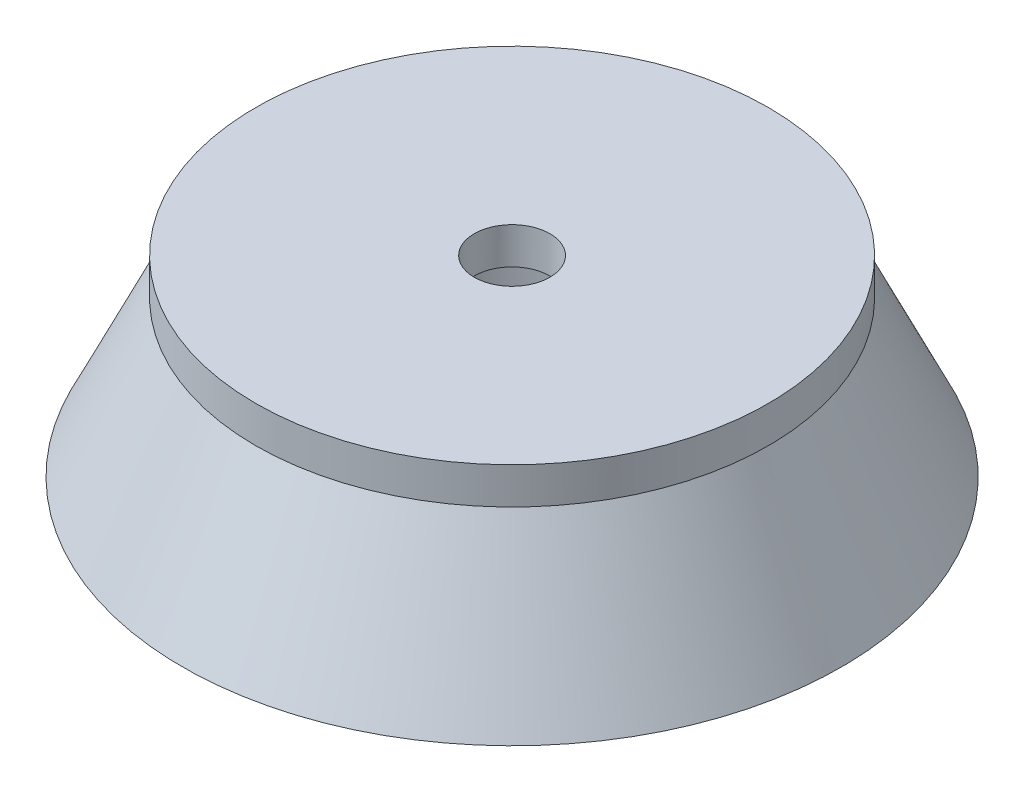
ISO-10303-21;
HEADER;
FILE_DESCRIPTION(('STEP AP214'),'2;1');
FILE_NAME('part.step','',(''),(''),'','','');
FILE_SCHEMA(('AUTOMOTIVE_DESIGN { 1 0 10303 214 1 1 1 1 }'));
ENDSEC;
DATA;
#1=APPLICATION_CONTEXT('core data for automotive mechanical design processes');
#2=APPLICATION_PROTOCOL_DEFINITION('international standard','automotive_design',2000,#1);
#3=PRODUCT_CONTEXT('',#1,'mechanical');
#4=PRODUCT('Part','Part','',(#3));
#5=PRODUCT_RELATED_PRODUCT_CATEGORY('part','',(#4));
#6=PRODUCT_DEFINITION_FORMATION('','',#4);
#7=PRODUCT_DEFINITION_CONTEXT('part definition',#1,'design');
#8=PRODUCT_DEFINITION('design','',#6,#7);
#9=PRODUCT_DEFINITION_SHAPE('','',#8);
#10=(LENGTH_UNIT() NAMED_UNIT(*) SI_UNIT(.MILLI.,.METRE.));
#11=(NAMED_UNIT(*) PLANE_ANGLE_UNIT() SI_UNIT($,.RADIAN.));
#12=(NAMED_UNIT(*) SI_UNIT($,.STERADIAN.) SOLID_ANGLE_UNIT());
#13=UNCERTAINTY_MEASURE_WITH_UNIT(LENGTH_MEASURE(1.E-05),#10,'distance_accuracy_value','');
#14=(GEOMETRIC_REPRESENTATION_CONTEXT(3) GLOBAL_UNCERTAINTY_ASSIGNED_CONTEXT((#13)) GLOBAL_UNIT_ASSIGNED_CONTEXT((#10,
#11,#12)) REPRESENTATION_CONTEXT('',''));
#15=CARTESIAN_POINT('',(0.,0.,0.));
#16=DIRECTION('',(0.,0.,1.));
#17=DIRECTION('',(1.,0.,0.));
#18=AXIS2_PLACEMENT_3D('',#15,#16,#17);
#19=CARTESIAN_POINT('',(0.,-38.0418880075335,0.));
#20=DIRECTION('',(0.,1.,0.));
#21=DIRECTION('',(0.,0.,1.));
#22=AXIS2_PLACEMENT_3D('',#19,#20,#21);
#23=CYLINDRICAL_SURFACE('',#22,5.16);
#24=CARTESIAN_POINT('',(0.,-11.8818880075335,0.));
#25=DIRECTION('',(0.,1.,0.));
#26=DIRECTION('',(0.,0.,1.));
#27=AXIS2_PLACEMENT_3D('',#24,#25,#26);
#28=CIRCLE('',#27,5.16);
#29=CARTESIAN_POINT('',(0.,-11.8818880075335,5.16));
#30=VERTEX_POINT('',#29);
#31=EDGE_CURVE('E166',#30,#30,#28,.T.);
#32=ORIENTED_EDGE('',*,*,#31,.T.);
#33=EDGE_LOOP('',(#32));
#34=FACE_BOUND('',#33,.T.);
#35=CARTESIAN_POINT('',(0.,-16.8818880075335,0.));
#36=DIRECTION('',(0.,-1.,0.));
#37=DIRECTION('',(0.,0.,-1.));
#38=AXIS2_PLACEMENT_3D('',#35,#36,#37);
#39=CIRCLE('',#38,5.16);
#40=CARTESIAN_POINT('',(0.,-16.8818880075335,-5.16));
#41=VERTEX_POINT('',#40);
#42=EDGE_CURVE('E171',#41,#41,#39,.F.);
#43=ORIENTED_EDGE('',*,*,#42,.F.);
#44=EDGE_LOOP('',(#43));
#45=FACE_BOUND('',#44,.T.);
#46=ADVANCED_FACE('F40',(#34,#45),#23,.F.);
#47=CARTESIAN_POINT('',(0.,-16.8818880075335,0.));
#48=DIRECTION('',(0.,-1.,0.));
#49=DIRECTION('',(0.,0.,-1.));
#50=AXIS2_PLACEMENT_3D('',#47,#48,#49);
#51=CONICAL_SURFACE('',#50,35.,0.44147998697415);
#52=CARTESIAN_POINT('',(15.,18.5509102217689,-10.4037733043237));
#53=CARTESIAN_POINT('',(15.,18.3433017300945,-10.5759155936755));
#54=CARTESIAN_POINT('',(15.,18.1342943657783,-10.7463569093923));
#55=CARTESIAN_POINT('',(15.,17.713783344793,-11.0841131957903));
#56=CARTESIAN_POINT('',(15.,17.5022798046306,-11.2514283114497));
#57=CARTESIAN_POINT('',(15.,16.8645462471954,-11.7490447256542));
#58=CARTESIAN_POINT('',(15.,16.4349969821519,-12.0750964626713));
#59=CARTESIAN_POINT('',(15.,15.5691674746087,-12.717413143118));
#60=CARTESIAN_POINT('',(15.,15.1328924680008,-13.0336851751639));
#61=CARTESIAN_POINT('',(15.,14.2545632272801,-13.6581477279574));
#62=CARTESIAN_POINT('',(15.,13.8125086158869,-13.9663377171397));
#63=CARTESIAN_POINT('',(15.,12.9243748526587,-14.5752626945275));
#64=CARTESIAN_POINT('',(15.,12.4783035406635,-14.8760091395697));
#65=CARTESIAN_POINT('',(15.,11.5821915710937,-15.4714990086351));
#66=CARTESIAN_POINT('',(15.,11.1321510010671,-15.7662425645887));
#67=CARTESIAN_POINT('',(15.,10.2285935969901,-16.3505674519497));
#68=CARTESIAN_POINT('',(15.,9.77507601620148,-16.6401476273597));
#69=CARTESIAN_POINT('',(15.,8.86514058867271,-17.2147141998104));
#70=CARTESIAN_POINT('',(15.,8.40872272616986,-17.4997005718544));
#71=CARTESIAN_POINT('',(15.,7.03781764903245,-18.3473002321399));
#72=CARTESIAN_POINT('',(15.,6.11960314464259,-18.9038886663724));
#73=CARTESIAN_POINT('',(15.,4.27566225366643,-20.0042613317756));
#74=CARTESIAN_POINT('',(15.,3.34993647646416,-20.5480465879651));
#75=CARTESIAN_POINT('',(15.,1.49203857057355,-21.6255559147405));
#76=CARTESIAN_POINT('',(15.,0.55986345735552,-22.1592748326424));
#77=CARTESIAN_POINT('',(15.,-1.30931699104298,-23.2182216335808));
#78=CARTESIAN_POINT('',(15.,-2.24632243394286,-23.7434493261679));
#79=CARTESIAN_POINT('',(15.,-4.44739197136428,-24.9663637502538));
#80=CARTESIAN_POINT('',(15.,-5.71304019464436,-25.6611977276136));
#81=CARTESIAN_POINT('',(15.,-8.24985394859188,-27.0406921683211));
#82=CARTESIAN_POINT('',(15.,-9.52101946394921,-27.7253526598763));
#83=CARTESIAN_POINT('',(15.,-12.0675326809664,-29.0862931328351));
#84=CARTESIAN_POINT('',(15.,-13.3428795942704,-29.7625745906849));
#85=CARTESIAN_POINT('',(15.,-15.8971527798239,-31.1083380069946));
#86=CARTESIAN_POINT('',(15.,-17.1760790521492,-31.7778199653103));
#87=CARTESIAN_POINT('',(15.,-19.7386614378065,-33.112035713019));
#88=CARTESIAN_POINT('',(15.,-21.0223216526531,-33.7767616199092));
#89=CARTESIAN_POINT('',(15.,-23.5921144552023,-35.1014137393453));
#90=CARTESIAN_POINT('',(15.,-24.8782470422335,-35.7613399531946));
#91=CARTESIAN_POINT('',(15.,-27.4526623783166,-37.0771357825336));
#92=CARTESIAN_POINT('',(15.,-28.7409452272427,-37.7330052025386));
#93=CARTESIAN_POINT('',(15.,-31.3192950582467,-39.0412285013179));
#94=CARTESIAN_POINT('',(15.,-32.6093620415655,-39.6935823776457));
#95=CARTESIAN_POINT('',(15.,-36.147504897582,-41.4775102561252));
#96=CARTESIAN_POINT('',(15.,-38.3971349588088,-42.6060019207853));
#97=CARTESIAN_POINT('',(15.,-42.9000249085706,-44.8557201598046));
#98=CARTESIAN_POINT('',(15.,-45.1532848014483,-45.9769467254639));
#99=CARTESIAN_POINT('',(15.,-49.6626800292881,-48.2135234699032));
#100=CARTESIAN_POINT('',(15.,-51.9188153248155,-49.3288737282193));
#101=CARTESIAN_POINT('',(15.,-56.4334495761568,-51.5547803211444));
#102=CARTESIAN_POINT('',(15.,-58.6919485327714,-52.665336654129));
#103=CARTESIAN_POINT('',(15.,-63.2045532325379,-54.8793629212199));
#104=CARTESIAN_POINT('',(15.,-65.45865351084,-55.9828439966343));
#105=CARTESIAN_POINT('',(15.,-69.9684749496831,-58.1864899001588));
#106=CARTESIAN_POINT('',(15.,-72.2241961106816,-59.2866547273328));
#107=CARTESIAN_POINT('',(15.,-76.7370013398238,-61.4841766074343));
#108=CARTESIAN_POINT('',(15.,-78.994085405984,-62.5815336644358));
#109=CARTESIAN_POINT('',(15.,-83.5094240037617,-64.7738322181987));
#110=CARTESIAN_POINT('',(15.,-85.767678534358,-65.8687737170632));
#111=CARTESIAN_POINT('',(15.,-88.0264224065465,-66.9627036974763));
#112=B_SPLINE_CURVE_WITH_KNOTS('',3,(#52,#53,#54,#55,#56,#57,#58,#59,#60,#61,#62,#63,#64,#65,
#66,#67,#68,#69,#70,#71,#72,#73,#74,#75,#76,#77,#78,#79,#80,#81,#82,#83,#84,#85,#86,#87,#88,#89,
#90,#91,#92,#93,#94,#95,#96,#97,#98,#99,#100,#101,#102,#103,#104,#105,#106,#107,#108,#109,#110,
#111),.UNSPECIFIED.,.F.,.F.,(4,2,2,2,2,2,2,2,2,2,2,2,2,2,2,2,2,2,2,2,2,2,2,2,2,2,2,2,2,4),(0.,
0.809055606012885,1.61807359829185,3.23573530983079,4.85219561605046,6.46876197348635,
8.08266221867131,9.69652695544467,11.3107485850433,12.9249789952925,16.1460375260273,
19.3668372967818,22.5892432592517,25.8117213969974,30.1431637850057,34.4745941612245,
38.8052501313474,43.1359061932253,47.4725746856741,51.8092420004721,56.1461166831567,
60.4829943834619,68.033403565624,75.5838217877278,83.1341375505706,90.6844558715771,
98.2135792421543,105.742704737791,113.271819302485,120.80092730929),.UNSPECIFIED.);
#113=CARTESIAN_POINT('',(15.,-33.0418880075335,-39.9113783445495));
#114=VERTEX_POINT('',#113);
#115=CARTESIAN_POINT('',(15.,-38.0418880075335,-42.4264068711929));
#116=VERTEX_POINT('',#115);
#117=EDGE_CURVE('E107',#114,#116,#112,.T.);
#118=ORIENTED_EDGE('',*,*,#117,.F.);
#119=CARTESIAN_POINT('',(0.,-33.0418880075335,0.));
#120=DIRECTION('',(0.,1.,0.));
#121=DIRECTION('',(0.,0.,1.));
#122=AXIS2_PLACEMENT_3D('',#119,#120,#121);
#123=CIRCLE('',#122,42.6370510396975);
#124=CARTESIAN_POINT('',(-15.,-33.0418880075335,-39.9113783445495));
#125=VERTEX_POINT('',#124);
#126=EDGE_CURVE('E99',#125,#114,#123,.F.);
#127=ORIENTED_EDGE('',*,*,#126,.F.);
#128=CARTESIAN_POINT('',(-15.,-88.0264224065465,-66.9627036974763));
#129=CARTESIAN_POINT('',(-15.,-85.7631325627987,-65.8665719514287));
#130=CARTESIAN_POINT('',(-15.,-83.5003339730482,-64.7694247288115));
#131=CARTESIAN_POINT('',(-15.,-78.9759157369345,-62.5727058633585));
#132=CARTESIAN_POINT('',(-15.,-76.7142960898387,-61.4731342220314));
#133=CARTESIAN_POINT('',(-15.,-72.1929442963464,-59.2714224430032));
#134=CARTESIAN_POINT('',(-15.,-69.9332118373779,-58.1692829473266));
#135=CARTESIAN_POINT('',(-15.,-65.4153718738621,-55.9616709848335));
#136=CARTESIAN_POINT('',(-15.,-63.1572643712611,-54.8561985140334));
#137=CARTESIAN_POINT('',(-15.,-58.6451831079306,-52.6423542339421));
#138=CARTESIAN_POINT('',(-15.,-56.3912074617096,-51.5339862685377));
#139=CARTESIAN_POINT('',(-15.,-51.8856211926528,-49.3124739237037));
#140=CARTESIAN_POINT('',(-15.,-49.63401056072,-48.199329562731));
#141=CARTESIAN_POINT('',(-15.,-45.1331876512589,-45.9669529964453));
#142=CARTESIAN_POINT('',(-15.,-42.8839760141268,-44.8477194994442));
#143=CARTESIAN_POINT('',(-15.,-38.3891388910709,-42.6019892002213));
#144=CARTESIAN_POINT('',(-15.,-36.1435134570745,-41.4754922939951));
#145=CARTESIAN_POINT('',(-15.,-31.6527738034662,-39.2112770938128));
#146=CARTESIAN_POINT('',(-15.,-29.4076680241057,-38.0735420499735));
#147=CARTESIAN_POINT('',(-15.,-24.9235921404898,-35.7862961478846));
#148=CARTESIAN_POINT('',(-15.,-22.6846217376359,-34.6367858760969));
#149=CARTESIAN_POINT('',(-15.,-19.3329275198519,-32.9010759764076));
#150=CARTESIAN_POINT('',(-15.,-18.2171506613246,-32.3207712026708));
#151=CARTESIAN_POINT('',(-15.,-15.9879983746219,-31.1555699245268));
#152=CARTESIAN_POINT('',(-15.,-14.8746229415949,-30.5706734294076));
#153=CARTESIAN_POINT('',(-15.,-12.6505133164454,-29.3953847260813));
#154=CARTESIAN_POINT('',(-15.,-11.5397796466592,-28.8049915287961));
#155=CARTESIAN_POINT('',(-15.,-9.32173601691805,-27.6178097574801));
#156=CARTESIAN_POINT('',(-15.,-8.21442604839713,-27.021021199467));
#157=CARTESIAN_POINT('',(-15.,-6.00177153095164,-25.8185694730033));
#158=CARTESIAN_POINT('',(-15.,-4.89643529736215,-25.2128909879638));
#159=CARTESIAN_POINT('',(-15.,-2.69097494538149,-23.9921712342265));
#160=CARTESIAN_POINT('',(-15.,-1.59085069054602,-23.3771302124262));
#161=CARTESIAN_POINT('',(-15.,0.602274781440196,-22.1357755482526));
#162=CARTESIAN_POINT('',(-15.,1.69527939752402,-21.5094679188656));
#163=CARTESIAN_POINT('',(-15.,3.87295256522627,-20.2422202372135));
#164=CARTESIAN_POINT('',(-15.,4.95762027536615,-19.6012787331554));
#165=CARTESIAN_POINT('',(-15.,6.57737667014326,-18.6250081916982));
#166=CARTESIAN_POINT('',(-15.,7.11670992377803,-18.2967184599128));
#167=CARTESIAN_POINT('',(-15.,8.1920261230104,-17.6346985427137));
#168=CARTESIAN_POINT('',(-15.,8.72800909444856,-17.3009683993336));
#169=CARTESIAN_POINT('',(-15.,9.79586967483993,-16.627318829886));
#170=CARTESIAN_POINT('',(-15.,10.3277483745181,-16.2874011349298));
#171=CARTESIAN_POINT('',(-15.,11.3867817862869,-15.6002358147318));
#172=CARTESIAN_POINT('',(-15.,11.9139363516581,-15.2529879629504));
#173=CARTESIAN_POINT('',(-15.,12.9634348473291,-14.5492403838741));
#174=CARTESIAN_POINT('',(-15.,13.4857682681996,-14.1927249589821));
#175=CARTESIAN_POINT('',(-15.,14.5232500385952,-13.4694437413992));
#176=CARTESIAN_POINT('',(-15.,15.0383990341705,-13.1026788794018));
#177=CARTESIAN_POINT('',(-15.,15.8045790863004,-12.5430706846708));
#178=CARTESIAN_POINT('',(-15.,16.0590018693,-12.3548656070828));
#179=CARTESIAN_POINT('',(-15.,16.5652701894105,-11.9750261263123));
#180=CARTESIAN_POINT('',(-15.,16.8171157770315,-11.7833917905426));
#181=CARTESIAN_POINT('',(-15.,17.3179561475205,-11.396271984959));
#182=CARTESIAN_POINT('',(-15.,17.5669500466412,-11.2007853697859));
#183=CARTESIAN_POINT('',(-15.,18.061572406122,-10.8055681964833));
#184=CARTESIAN_POINT('',(-15.,18.3072006338427,-10.6058373473968));
#185=CARTESIAN_POINT('',(-15.,18.5509102217689,-10.4037733043237));
#186=B_SPLINE_CURVE_WITH_KNOTS('',3,(#128,#129,#130,#131,#132,#133,#134,#135,#136,#137,#138,
#139,#140,#141,#142,#143,#144,#145,#146,#147,#148,#149,#150,#151,#152,#153,#154,#155,#156,#157,
#158,#159,#160,#161,#162,#163,#164,#165,#166,#167,#168,#169,#170,#171,#172,#173,#174,#175,#176,
#177,#178,#179,#180,#181,#182,#183,#184,#185),.UNSPECIFIED.,.F.,.F.,(4,2,2,2,2,2,2,2,2,2,2,2,2,
2,2,2,2,2,2,2,2,2,2,2,2,2,2,2,4),(0.,7.54426131680242,15.0885179404058,22.6310563236457,
30.173603725679,37.7088477377607,45.2440626586169,52.7809437259147,60.3179329539686,
67.8687013586119,75.4190955102194,79.1920706330533,82.9650381259739,86.7386981795792,
90.512348784018,94.2935202530256,98.0745921816726,101.853702740922,105.633189860281,
107.527337073179,109.42146965853,111.315080222022,113.208749393765,115.105867273754,
117.002813443389,117.952194257968,118.901556429966,119.851205257149,120.800919397453),.UNSPECIFIED.);
#187=CARTESIAN_POINT('',(-15.,-38.0418880075335,-42.4264068711929));
#188=VERTEX_POINT('',#187);
#189=EDGE_CURVE('E66',#188,#125,#186,.T.);
#190=ORIENTED_EDGE('',*,*,#189,.F.);
#191=CARTESIAN_POINT('',(0.,-38.0418880075335,0.));
#192=DIRECTION('',(0.,1.,0.));
#193=DIRECTION('',(0.,0.,1.));
#194=AXIS2_PLACEMENT_3D('',#191,#192,#193);
#195=CIRCLE('',#194,45.);
#196=EDGE_CURVE('E158',#188,#116,#195,.T.);
#197=ORIENTED_EDGE('',*,*,#196,.T.);
#198=EDGE_LOOP('',(#118,#127,#190,#197));
#199=FACE_BOUND('',#198,.T.);
#200=CARTESIAN_POINT('',(0.,-16.8818880075335,0.));
#201=DIRECTION('',(0.,1.,0.));
#202=DIRECTION('',(0.,0.,1.));
#203=AXIS2_PLACEMENT_3D('',#200,#201,#202);
#204=CIRCLE('',#203,35.);
#205=CARTESIAN_POINT('',(0.,-16.8818880075335,35.));
#206=VERTEX_POINT('',#205);
#207=EDGE_CURVE('E50',#206,#206,#204,.T.);
#208=ORIENTED_EDGE('',*,*,#207,.F.);
#209=EDGE_LOOP('',(#208));
#210=FACE_BOUND('',#209,.T.);
#211=ADVANCED_FACE('F42',(#199,#210),#51,.T.);
#212=CARTESIAN_POINT('',(0.,-38.0418880075335,0.));
#213=DIRECTION('',(0.,-1.,0.));
#214=DIRECTION('',(0.,0.,-1.));
#215=AXIS2_PLACEMENT_3D('',#212,#213,#214);
#216=PLANE('',#215);
#217=DIRECTION('',(0.,0.,1.));
#218=VECTOR('',#217,1.);
#219=CARTESIAN_POINT('',(15.,-38.0418880075335,0.));
#220=LINE('',#219,#218);
#221=CARTESIAN_POINT('',(15.,-38.0418880075335,0.));
#222=VERTEX_POINT('',#221);
#223=EDGE_CURVE('E156',#116,#222,#220,.T.);
#224=ORIENTED_EDGE('',*,*,#223,.F.);
#225=ORIENTED_EDGE('',*,*,#196,.F.);
#226=DIRECTION('',(0.,0.,-1.));
#227=VECTOR('',#226,1.);
#228=CARTESIAN_POINT('',(-15.,-38.0418880075335,0.));
#229=LINE('',#228,#227);
#230=CARTESIAN_POINT('',(-15.,-38.0418880075335,0.));
#231=VERTEX_POINT('',#230);
#232=EDGE_CURVE('E108',#231,#188,#229,.T.);
#233=ORIENTED_EDGE('',*,*,#232,.F.);
#234=CARTESIAN_POINT('',(0.,-38.0418880075335,0.));
#235=DIRECTION('',(0.,-1.,0.));
#236=DIRECTION('',(0.,0.,-1.));
#237=AXIS2_PLACEMENT_3D('',#234,#235,#236);
#238=CIRCLE('',#237,15.);
#239=EDGE_CURVE('E98',#222,#231,#238,.T.);
#240=ORIENTED_EDGE('',*,*,#239,.F.);
#241=EDGE_LOOP('',(#224,#225,#233,#240));
#242=FACE_BOUND('',#241,.T.);
#243=ADVANCED_FACE('F146',(#242),#216,.T.);
#244=CARTESIAN_POINT('',(0.,-11.8818880075335,0.));
#245=DIRECTION('',(0.,-1.,0.));
#246=DIRECTION('',(0.,0.,-1.));
#247=AXIS2_PLACEMENT_3D('',#244,#245,#246);
#248=CYLINDRICAL_SURFACE('',#247,35.);
#249=CARTESIAN_POINT('',(0.,-11.8818880075335,0.));
#250=DIRECTION('',(0.,1.,0.));
#251=DIRECTION('',(0.,0.,1.));
#252=AXIS2_PLACEMENT_3D('',#249,#250,#251);
#253=CIRCLE('',#252,35.);
#254=CARTESIAN_POINT('',(0.,-11.8818880075335,35.));
#255=VERTEX_POINT('',#254);
#256=EDGE_CURVE('E162',#255,#255,#253,.T.);
#257=ORIENTED_EDGE('',*,*,#256,.F.);
#258=EDGE_LOOP('',(#257));
#259=FACE_BOUND('',#258,.T.);
#260=ORIENTED_EDGE('',*,*,#207,.T.);
#261=EDGE_LOOP('',(#260));
#262=FACE_BOUND('',#261,.T.);
#263=ADVANCED_FACE('F143',(#259,#262),#248,.T.);
#264=CARTESIAN_POINT('',(0.,-11.8818880075335,0.));
#265=DIRECTION('',(0.,1.,0.));
#266=DIRECTION('',(0.,0.,1.));
#267=AXIS2_PLACEMENT_3D('',#264,#265,#266);
#268=PLANE('',#267);
#269=ORIENTED_EDGE('',*,*,#31,.F.);
#270=EDGE_LOOP('',(#269));
#271=FACE_BOUND('',#270,.T.);
#272=ORIENTED_EDGE('',*,*,#256,.T.);
#273=EDGE_LOOP('',(#272));
#274=FACE_BOUND('',#273,.T.);
#275=ADVANCED_FACE('F134',(#271,#274),#268,.T.);
#276=CARTESIAN_POINT('',(0.,-16.8818880075335,0.));
#277=DIRECTION('',(0.,-1.,0.));
#278=DIRECTION('',(0.,0.,-1.));
#279=AXIS2_PLACEMENT_3D('',#276,#277,#278);
#280=PLANE('',#279);
#281=CARTESIAN_POINT('',(0.,-16.8818880075335,0.));
#282=DIRECTION('',(0.,-1.,0.));
#283=DIRECTION('',(0.,0.,-1.));
#284=AXIS2_PLACEMENT_3D('',#281,#282,#283);
#285=CIRCLE('',#284,15.);
#286=CARTESIAN_POINT('',(0.,-16.8818880075335,-15.));
#287=VERTEX_POINT('',#286);
#288=EDGE_CURVE('E175',#287,#287,#285,.T.);
#289=ORIENTED_EDGE('',*,*,#288,.T.);
#290=EDGE_LOOP('',(#289));
#291=FACE_BOUND('',#290,.T.);
#292=ORIENTED_EDGE('',*,*,#42,.T.);
#293=EDGE_LOOP('',(#292));
#294=FACE_BOUND('',#293,.T.);
#295=ADVANCED_FACE('F131',(#291,#294),#280,.T.);
#296=CARTESIAN_POINT('',(0.,-16.8818880075335,0.));
#297=DIRECTION('',(0.,-1.,0.));
#298=DIRECTION('',(0.,0.,-1.));
#299=AXIS2_PLACEMENT_3D('',#296,#297,#298);
#300=CYLINDRICAL_SURFACE('',#299,15.);
#301=ORIENTED_EDGE('',*,*,#239,.T.);
#302=DIRECTION('',(0.,-1.,0.));
#303=VECTOR('',#302,1.);
#304=CARTESIAN_POINT('',(-15.,-33.0418880075335,0.));
#305=LINE('',#304,#303);
#306=CARTESIAN_POINT('',(-15.,-33.0418880075335,0.));
#307=VERTEX_POINT('',#306);
#308=EDGE_CURVE('E91',#307,#231,#305,.T.);
#309=ORIENTED_EDGE('',*,*,#308,.F.);
#310=CARTESIAN_POINT('',(0.,-33.0418880075335,0.));
#311=DIRECTION('',(0.,1.,0.));
#312=DIRECTION('',(0.,0.,1.));
#313=AXIS2_PLACEMENT_3D('',#310,#311,#312);
#314=CIRCLE('',#313,15.);
#315=CARTESIAN_POINT('',(15.,-33.0418880075335,0.));
#316=VERTEX_POINT('',#315);
#317=EDGE_CURVE('E11',#307,#316,#314,.F.);
#318=ORIENTED_EDGE('',*,*,#317,.T.);
#319=DIRECTION('',(0.,-1.,0.));
#320=VECTOR('',#319,1.);
#321=CARTESIAN_POINT('',(15.,-33.0418880075335,0.));
#322=LINE('',#321,#320);
#323=EDGE_CURVE('E58',#316,#222,#322,.T.);
#324=ORIENTED_EDGE('',*,*,#323,.T.);
#325=EDGE_LOOP('',(#301,#309,#318,#324));
#326=FACE_BOUND('',#325,.T.);
#327=ORIENTED_EDGE('',*,*,#288,.F.);
#328=EDGE_LOOP('',(#327));
#329=FACE_BOUND('',#328,.T.);
#330=ADVANCED_FACE('F95',(#326,#329),#300,.F.);
#331=CARTESIAN_POINT('',(-0.00166190205299871,-33.0418880075335,-45.000000098827));
#332=DIRECTION('',(0.,1.,0.));
#333=DIRECTION('',(0.,0.,1.));
#334=AXIS2_PLACEMENT_3D('',#331,#332,#333);
#335=PLANE('',#334);
#336=ORIENTED_EDGE('',*,*,#126,.T.);
#337=DIRECTION('',(0.,0.,1.));
#338=VECTOR('',#337,1.);
#339=CARTESIAN_POINT('',(15.,-33.0418880075335,0.));
#340=LINE('',#339,#338);
#341=EDGE_CURVE('E87',#114,#316,#340,.T.);
#342=ORIENTED_EDGE('',*,*,#341,.T.);
#343=ORIENTED_EDGE('',*,*,#317,.F.);
#344=DIRECTION('',(0.,0.,-1.));
#345=VECTOR('',#344,1.);
#346=CARTESIAN_POINT('',(-15.,-33.0418880075335,0.));
#347=LINE('',#346,#345);
#348=EDGE_CURVE('E85',#307,#125,#347,.T.);
#349=ORIENTED_EDGE('',*,*,#348,.T.);
#350=EDGE_LOOP('',(#336,#342,#343,#349));
#351=FACE_BOUND('',#350,.T.);
#352=ADVANCED_FACE('F84',(#351),#335,.F.);
#353=CARTESIAN_POINT('',(15.,-33.0418880075335,0.));
#354=DIRECTION('',(1.,0.,0.));
#355=DIRECTION('',(0.,0.,-1.));
#356=AXIS2_PLACEMENT_3D('',#353,#354,#355);
#357=PLANE('',#356);
#358=ORIENTED_EDGE('',*,*,#117,.T.);
#359=ORIENTED_EDGE('',*,*,#223,.T.);
#360=ORIENTED_EDGE('',*,*,#323,.F.);
#361=ORIENTED_EDGE('',*,*,#341,.F.);
#362=EDGE_LOOP('',(#358,#359,#360,#361));
#363=FACE_BOUND('',#362,.T.);
#364=ADVANCED_FACE('F127',(#363),#357,.F.);
#365=CARTESIAN_POINT('',(-15.,-33.0418880075335,0.));
#366=DIRECTION('',(-1.,0.,0.));
#367=DIRECTION('',(0.,0.,1.));
#368=AXIS2_PLACEMENT_3D('',#365,#366,#367);
#369=PLANE('',#368);
#370=ORIENTED_EDGE('',*,*,#189,.T.);
#371=ORIENTED_EDGE('',*,*,#348,.F.);
#372=ORIENTED_EDGE('',*,*,#308,.T.);
#373=ORIENTED_EDGE('',*,*,#232,.T.);
#374=EDGE_LOOP('',(#370,#371,#372,#373));
#375=FACE_BOUND('',#374,.T.);
#376=ADVANCED_FACE('F90',(#375),#369,.F.);
#377=CLOSED_SHELL('',(#46,#211,#243,#263,#275,#295,#330,#352,#364,#376));
#378=MANIFOLD_SOLID_BREP('B2',#377);
#379=ADVANCED_BREP_SHAPE_REPRESENTATION('',(#18,#378),#14);
#380=SHAPE_DEFINITION_REPRESENTATION(#9,#379);
ENDSEC;
END-ISO-10303-21;
